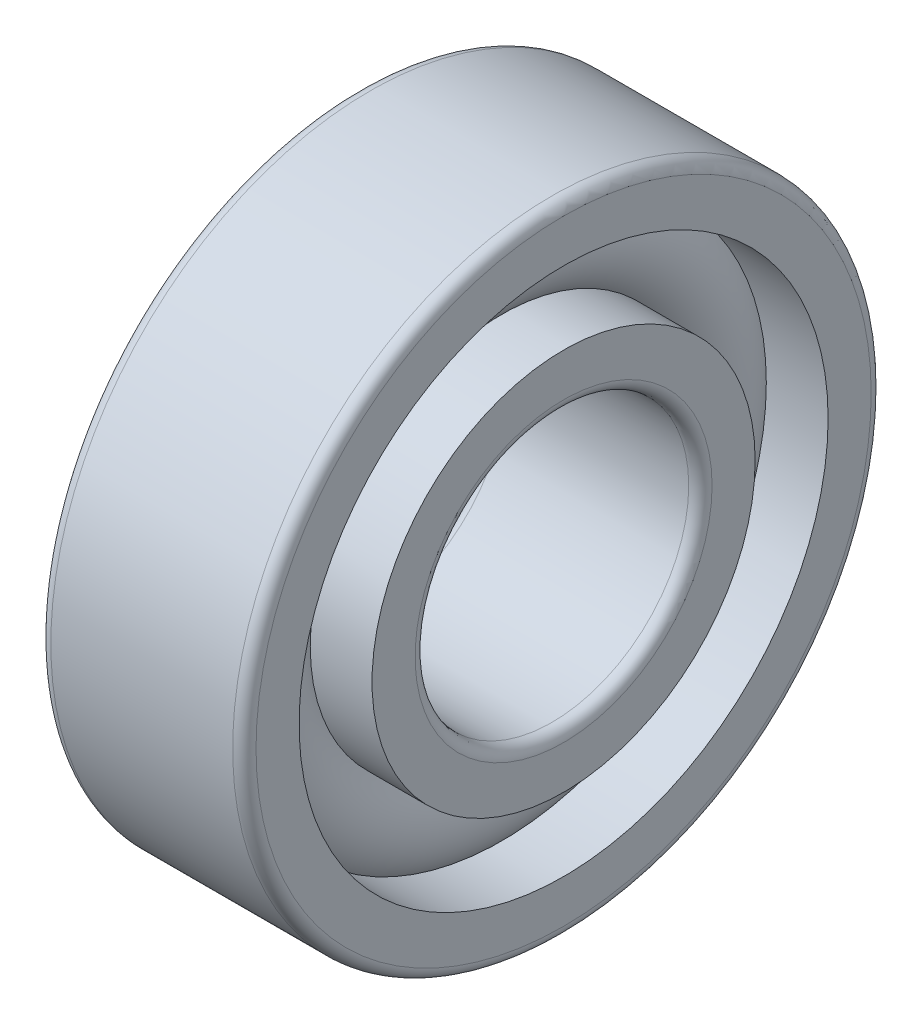
ISO-10303-21;
HEADER;
FILE_DESCRIPTION(('STEP AP214'),'2;1');
FILE_NAME('part.step','',(''),(''),'','','');
FILE_SCHEMA(('AUTOMOTIVE_DESIGN { 1 0 10303 214 1 1 1 1 }'));
ENDSEC;
DATA;
#1=APPLICATION_CONTEXT('core data for automotive mechanical design processes');
#2=APPLICATION_PROTOCOL_DEFINITION('international standard','automotive_design',2000,#1);
#3=PRODUCT_CONTEXT('',#1,'mechanical');
#4=PRODUCT('Part','Part','',(#3));
#5=PRODUCT_RELATED_PRODUCT_CATEGORY('part','',(#4));
#6=PRODUCT_DEFINITION_FORMATION('','',#4);
#7=PRODUCT_DEFINITION_CONTEXT('part definition',#1,'design');
#8=PRODUCT_DEFINITION('design','',#6,#7);
#9=PRODUCT_DEFINITION_SHAPE('','',#8);
#10=(LENGTH_UNIT() NAMED_UNIT(*) SI_UNIT(.MILLI.,.METRE.));
#11=(NAMED_UNIT(*) PLANE_ANGLE_UNIT() SI_UNIT($,.RADIAN.));
#12=(NAMED_UNIT(*) SI_UNIT($,.STERADIAN.) SOLID_ANGLE_UNIT());
#13=UNCERTAINTY_MEASURE_WITH_UNIT(LENGTH_MEASURE(1.E-05),#10,'distance_accuracy_value','');
#14=(GEOMETRIC_REPRESENTATION_CONTEXT(3) GLOBAL_UNCERTAINTY_ASSIGNED_CONTEXT((#13)) GLOBAL_UNIT_ASSIGNED_CONTEXT((#10,
#11,#12)) REPRESENTATION_CONTEXT('',''));
#15=CARTESIAN_POINT('',(0.,0.,0.));
#16=DIRECTION('',(0.,0.,1.));
#17=DIRECTION('',(1.,0.,0.));
#18=AXIS2_PLACEMENT_3D('',#15,#16,#17);
#19=CARTESIAN_POINT('',(0.,0.,0.));
#20=DIRECTION('',(-1.,0.,0.));
#21=DIRECTION('',(0.,0.,1.));
#22=AXIS2_PLACEMENT_3D('',#19,#20,#21);
#23=TOROIDAL_SURFACE('',#22,7.9375,1.905);
#24=CARTESIAN_POINT('',(1.41990316571236,0.,0.));
#25=DIRECTION('',(-1.,0.,0.));
#26=DIRECTION('',(0.,0.,1.));
#27=AXIS2_PLACEMENT_3D('',#24,#25,#26);
#28=CIRCLE('',#27,9.2075);
#29=CARTESIAN_POINT('',(1.41990316571236,0.,9.2075));
#30=VERTEX_POINT('',#29);
#31=EDGE_CURVE('E34',#30,#30,#28,.F.);
#32=ORIENTED_EDGE('',*,*,#31,.T.);
#33=EDGE_LOOP('',(#32));
#34=FACE_BOUND('',#33,.T.);
#35=CARTESIAN_POINT('',(1.41990316571237,0.,0.));
#36=DIRECTION('',(-1.,0.,0.));
#37=DIRECTION('',(0.,0.,1.));
#38=AXIS2_PLACEMENT_3D('',#35,#36,#37);
#39=CIRCLE('',#38,6.6675);
#40=CARTESIAN_POINT('',(1.41990316571237,0.,6.6675));
#41=VERTEX_POINT('',#40);
#42=EDGE_CURVE('E10',#41,#41,#39,.T.);
#43=ORIENTED_EDGE('',*,*,#42,.T.);
#44=EDGE_LOOP('',(#43));
#45=FACE_BOUND('',#44,.T.);
#46=ADVANCED_FACE('F30',(#34,#45),#23,.T.);
#47=CARTESIAN_POINT('',(-20.6375,0.,0.));
#48=DIRECTION('',(1.,0.,0.));
#49=DIRECTION('',(0.,0.,-1.));
#50=AXIS2_PLACEMENT_3D('',#47,#48,#49);
#51=CYLINDRICAL_SURFACE('',#50,6.6675);
#52=CARTESIAN_POINT('',(3.57124,0.,0.));
#53=DIRECTION('',(1.,0.,0.));
#54=DIRECTION('',(0.,0.,-1.));
#55=AXIS2_PLACEMENT_3D('',#52,#53,#54);
#56=CIRCLE('',#55,6.6675);
#57=CARTESIAN_POINT('',(3.57124,0.,-6.6675));
#58=VERTEX_POINT('',#57);
#59=EDGE_CURVE('E43',#58,#58,#56,.T.);
#60=ORIENTED_EDGE('',*,*,#59,.F.);
#61=EDGE_LOOP('',(#60));
#62=FACE_BOUND('',#61,.T.);
#63=ORIENTED_EDGE('',*,*,#42,.F.);
#64=EDGE_LOOP('',(#63));
#65=FACE_BOUND('',#64,.T.);
#66=ADVANCED_FACE('F82',(#62,#65),#51,.T.);
#67=CARTESIAN_POINT('',(-20.6375,0.,0.));
#68=DIRECTION('',(1.,0.,0.));
#69=DIRECTION('',(0.,0.,-1.));
#70=AXIS2_PLACEMENT_3D('',#67,#68,#69);
#71=CYLINDRICAL_SURFACE('',#70,6.6675);
#72=CARTESIAN_POINT('',(-3.57124,0.,0.));
#73=DIRECTION('',(1.,0.,0.));
#74=DIRECTION('',(0.,0.,-1.));
#75=AXIS2_PLACEMENT_3D('',#72,#73,#74);
#76=CIRCLE('',#75,6.6675);
#77=CARTESIAN_POINT('',(-3.57124,0.,-6.6675));
#78=VERTEX_POINT('',#77);
#79=EDGE_CURVE('E52',#78,#78,#76,.T.);
#80=ORIENTED_EDGE('',*,*,#79,.T.);
#81=EDGE_LOOP('',(#80));
#82=FACE_BOUND('',#81,.T.);
#83=CARTESIAN_POINT('',(-1.41990316571237,0.,0.));
#84=DIRECTION('',(1.,0.,0.));
#85=DIRECTION('',(0.,0.,-1.));
#86=AXIS2_PLACEMENT_3D('',#83,#84,#85);
#87=CIRCLE('',#86,6.6675);
#88=CARTESIAN_POINT('',(-1.41990316571237,0.,-6.6675));
#89=VERTEX_POINT('',#88);
#90=EDGE_CURVE('E38',#89,#89,#87,.T.);
#91=ORIENTED_EDGE('',*,*,#90,.F.);
#92=EDGE_LOOP('',(#91));
#93=FACE_BOUND('',#92,.T.);
#94=ADVANCED_FACE('F85',(#82,#93),#71,.T.);
#95=CARTESIAN_POINT('',(3.57124,5.1689,0.));
#96=DIRECTION('',(1.,0.,0.));
#97=DIRECTION('',(0.,0.,-1.));
#98=AXIS2_PLACEMENT_3D('',#95,#96,#97);
#99=PLANE('',#98);
#100=ORIENTED_EDGE('',*,*,#59,.T.);
#101=EDGE_LOOP('',(#100));
#102=FACE_BOUND('',#101,.T.);
#103=CARTESIAN_POINT('',(3.57124,0.,0.));
#104=DIRECTION('',(1.,0.,0.));
#105=DIRECTION('',(0.,0.,-1.));
#106=AXIS2_PLACEMENT_3D('',#103,#104,#105);
#107=CIRCLE('',#106,5.1689);
#108=CARTESIAN_POINT('',(3.57124,0.,-5.1689));
#109=VERTEX_POINT('',#108);
#110=EDGE_CURVE('E74',#109,#109,#107,.T.);
#111=ORIENTED_EDGE('',*,*,#110,.F.);
#112=EDGE_LOOP('',(#111));
#113=FACE_BOUND('',#112,.T.);
#114=ADVANCED_FACE('F79',(#102,#113),#99,.T.);
#115=CARTESIAN_POINT('',(3.16484,0.,0.));
#116=DIRECTION('',(1.,0.,0.));
#117=DIRECTION('',(0.,0.,-1.));
#118=AXIS2_PLACEMENT_3D('',#115,#116,#117);
#119=TOROIDAL_SURFACE('',#118,5.1689,0.406400000000001);
#120=ORIENTED_EDGE('',*,*,#110,.T.);
#121=EDGE_LOOP('',(#120));
#122=FACE_BOUND('',#121,.T.);
#123=CARTESIAN_POINT('',(3.16484,0.,0.));
#124=DIRECTION('',(1.,0.,0.));
#125=DIRECTION('',(0.,0.,-1.));
#126=AXIS2_PLACEMENT_3D('',#123,#124,#125);
#127=CIRCLE('',#126,4.7625);
#128=CARTESIAN_POINT('',(3.16484,0.,-4.7625));
#129=VERTEX_POINT('',#128);
#130=EDGE_CURVE('E71',#129,#129,#127,.T.);
#131=ORIENTED_EDGE('',*,*,#130,.F.);
#132=EDGE_LOOP('',(#131));
#133=FACE_BOUND('',#132,.T.);
#134=ADVANCED_FACE('F96',(#122,#133),#119,.T.);
#135=CARTESIAN_POINT('',(-20.6375,0.,0.));
#136=DIRECTION('',(1.,0.,0.));
#137=DIRECTION('',(0.,0.,-1.));
#138=AXIS2_PLACEMENT_3D('',#135,#136,#137);
#139=CYLINDRICAL_SURFACE('',#138,4.7625);
#140=ORIENTED_EDGE('',*,*,#130,.T.);
#141=EDGE_LOOP('',(#140));
#142=FACE_BOUND('',#141,.T.);
#143=CARTESIAN_POINT('',(-3.16484,0.,0.));
#144=DIRECTION('',(1.,0.,0.));
#145=DIRECTION('',(0.,0.,-1.));
#146=AXIS2_PLACEMENT_3D('',#143,#144,#145);
#147=CIRCLE('',#146,4.7625);
#148=CARTESIAN_POINT('',(-3.16484,0.,-4.7625));
#149=VERTEX_POINT('',#148);
#150=EDGE_CURVE('E68',#149,#149,#147,.T.);
#151=ORIENTED_EDGE('',*,*,#150,.F.);
#152=EDGE_LOOP('',(#151));
#153=FACE_BOUND('',#152,.T.);
#154=ADVANCED_FACE('F99',(#142,#153),#139,.F.);
#155=CARTESIAN_POINT('',(-3.16484,0.,0.));
#156=DIRECTION('',(1.,0.,0.));
#157=DIRECTION('',(0.,0.,-1.));
#158=AXIS2_PLACEMENT_3D('',#155,#156,#157);
#159=TOROIDAL_SURFACE('',#158,5.1689,0.406400000000001);
#160=ORIENTED_EDGE('',*,*,#150,.T.);
#161=EDGE_LOOP('',(#160));
#162=FACE_BOUND('',#161,.T.);
#163=CARTESIAN_POINT('',(-3.57124,0.,0.));
#164=DIRECTION('',(1.,0.,0.));
#165=DIRECTION('',(0.,0.,-1.));
#166=AXIS2_PLACEMENT_3D('',#163,#164,#165);
#167=CIRCLE('',#166,5.1689);
#168=CARTESIAN_POINT('',(-3.57124,0.,-5.1689));
#169=VERTEX_POINT('',#168);
#170=EDGE_CURVE('E65',#169,#169,#167,.T.);
#171=ORIENTED_EDGE('',*,*,#170,.F.);
#172=EDGE_LOOP('',(#171));
#173=FACE_BOUND('',#172,.T.);
#174=ADVANCED_FACE('F103',(#162,#173),#159,.T.);
#175=CARTESIAN_POINT('',(-3.57124,6.6675,0.));
#176=DIRECTION('',(-1.,0.,0.));
#177=DIRECTION('',(0.,0.,1.));
#178=AXIS2_PLACEMENT_3D('',#175,#176,#177);
#179=PLANE('',#178);
#180=ORIENTED_EDGE('',*,*,#170,.T.);
#181=EDGE_LOOP('',(#180));
#182=FACE_BOUND('',#181,.T.);
#183=ORIENTED_EDGE('',*,*,#79,.F.);
#184=EDGE_LOOP('',(#183));
#185=FACE_BOUND('',#184,.T.);
#186=ADVANCED_FACE('F107',(#182,#185),#179,.T.);
#187=CARTESIAN_POINT('',(-1.41990316571236,0.,0.));
#188=DIRECTION('',(1.,0.,0.));
#189=DIRECTION('',(0.,0.,-1.));
#190=AXIS2_PLACEMENT_3D('',#187,#188,#189);
#191=CIRCLE('',#190,9.2075);
#192=CARTESIAN_POINT('',(-1.41990316571236,0.,-9.2075));
#193=VERTEX_POINT('',#192);
#194=EDGE_CURVE('E46',#193,#193,#191,.F.);
#195=ORIENTED_EDGE('',*,*,#194,.T.);
#196=EDGE_LOOP('',(#195));
#197=FACE_BOUND('',#196,.T.);
#198=ORIENTED_EDGE('',*,*,#90,.T.);
#199=EDGE_LOOP('',(#198));
#200=FACE_BOUND('',#199,.T.);
#201=ADVANCED_FACE('F32',(#197,#200),#23,.T.);
#202=CARTESIAN_POINT('',(-20.6375,0.,0.));
#203=DIRECTION('',(1.,0.,0.));
#204=DIRECTION('',(0.,0.,-1.));
#205=AXIS2_PLACEMENT_3D('',#202,#203,#204);
#206=CYLINDRICAL_SURFACE('',#205,9.2075);
#207=CARTESIAN_POINT('',(3.57124,0.,0.));
#208=DIRECTION('',(1.,0.,0.));
#209=DIRECTION('',(0.,0.,-1.));
#210=AXIS2_PLACEMENT_3D('',#207,#208,#209);
#211=CIRCLE('',#210,9.2075);
#212=CARTESIAN_POINT('',(3.57124,0.,-9.2075));
#213=VERTEX_POINT('',#212);
#214=EDGE_CURVE('E48',#213,#213,#211,.T.);
#215=ORIENTED_EDGE('',*,*,#214,.T.);
#216=EDGE_LOOP('',(#215));
#217=FACE_BOUND('',#216,.T.);
#218=ORIENTED_EDGE('',*,*,#31,.F.);
#219=EDGE_LOOP('',(#218));
#220=FACE_BOUND('',#219,.T.);
#221=ADVANCED_FACE('F112',(#217,#220),#206,.F.);
#222=CARTESIAN_POINT('',(-20.6375,0.,0.));
#223=DIRECTION('',(1.,0.,0.));
#224=DIRECTION('',(0.,0.,-1.));
#225=AXIS2_PLACEMENT_3D('',#222,#223,#224);
#226=CYLINDRICAL_SURFACE('',#225,9.2075);
#227=CARTESIAN_POINT('',(-3.57124,0.,0.));
#228=DIRECTION('',(1.,0.,0.));
#229=DIRECTION('',(0.,0.,-1.));
#230=AXIS2_PLACEMENT_3D('',#227,#228,#229);
#231=CIRCLE('',#230,9.2075);
#232=CARTESIAN_POINT('',(-3.57124,0.,-9.2075));
#233=VERTEX_POINT('',#232);
#234=EDGE_CURVE('E143',#233,#233,#231,.T.);
#235=ORIENTED_EDGE('',*,*,#234,.F.);
#236=EDGE_LOOP('',(#235));
#237=FACE_BOUND('',#236,.T.);
#238=ORIENTED_EDGE('',*,*,#194,.F.);
#239=EDGE_LOOP('',(#238));
#240=FACE_BOUND('',#239,.T.);
#241=ADVANCED_FACE('F115',(#237,#240),#226,.F.);
#242=CARTESIAN_POINT('',(3.57124,10.7061,0.));
#243=DIRECTION('',(1.,0.,0.));
#244=DIRECTION('',(0.,0.,-1.));
#245=AXIS2_PLACEMENT_3D('',#242,#243,#244);
#246=PLANE('',#245);
#247=CARTESIAN_POINT('',(3.57124,0.,0.));
#248=DIRECTION('',(1.,0.,0.));
#249=DIRECTION('',(0.,0.,-1.));
#250=AXIS2_PLACEMENT_3D('',#247,#248,#249);
#251=CIRCLE('',#250,10.7061);
#252=CARTESIAN_POINT('',(3.57124,0.,-10.7061));
#253=VERTEX_POINT('',#252);
#254=EDGE_CURVE('E54',#253,#253,#251,.T.);
#255=ORIENTED_EDGE('',*,*,#254,.T.);
#256=EDGE_LOOP('',(#255));
#257=FACE_BOUND('',#256,.T.);
#258=ORIENTED_EDGE('',*,*,#214,.F.);
#259=EDGE_LOOP('',(#258));
#260=FACE_BOUND('',#259,.T.);
#261=ADVANCED_FACE('F116',(#257,#260),#246,.T.);
#262=CARTESIAN_POINT('',(3.16484,0.,0.));
#263=DIRECTION('',(1.,0.,0.));
#264=DIRECTION('',(0.,0.,-1.));
#265=AXIS2_PLACEMENT_3D('',#262,#263,#264);
#266=TOROIDAL_SURFACE('',#265,10.7061,0.406400000000001);
#267=CARTESIAN_POINT('',(3.16484,0.,0.));
#268=DIRECTION('',(1.,0.,0.));
#269=DIRECTION('',(0.,0.,-1.));
#270=AXIS2_PLACEMENT_3D('',#267,#268,#269);
#271=CIRCLE('',#270,11.1125);
#272=CARTESIAN_POINT('',(3.16484,0.,-11.1125));
#273=VERTEX_POINT('',#272);
#274=EDGE_CURVE('E59',#273,#273,#271,.T.);
#275=ORIENTED_EDGE('',*,*,#274,.T.);
#276=EDGE_LOOP('',(#275));
#277=FACE_BOUND('',#276,.T.);
#278=ORIENTED_EDGE('',*,*,#254,.F.);
#279=EDGE_LOOP('',(#278));
#280=FACE_BOUND('',#279,.T.);
#281=ADVANCED_FACE('F119',(#277,#280),#266,.T.);
#282=CARTESIAN_POINT('',(-20.6375,0.,0.));
#283=DIRECTION('',(1.,0.,0.));
#284=DIRECTION('',(0.,0.,-1.));
#285=AXIS2_PLACEMENT_3D('',#282,#283,#284);
#286=CYLINDRICAL_SURFACE('',#285,11.1125);
#287=CARTESIAN_POINT('',(-3.16484,0.,0.));
#288=DIRECTION('',(1.,0.,0.));
#289=DIRECTION('',(0.,0.,-1.));
#290=AXIS2_PLACEMENT_3D('',#287,#288,#289);
#291=CIRCLE('',#290,11.1125);
#292=CARTESIAN_POINT('',(-3.16484,0.,-11.1125));
#293=VERTEX_POINT('',#292);
#294=EDGE_CURVE('E147',#293,#293,#291,.T.);
#295=ORIENTED_EDGE('',*,*,#294,.T.);
#296=EDGE_LOOP('',(#295));
#297=FACE_BOUND('',#296,.T.);
#298=ORIENTED_EDGE('',*,*,#274,.F.);
#299=EDGE_LOOP('',(#298));
#300=FACE_BOUND('',#299,.T.);
#301=ADVANCED_FACE('F123',(#297,#300),#286,.T.);
#302=CARTESIAN_POINT('',(-3.16484,0.,0.));
#303=DIRECTION('',(1.,0.,0.));
#304=DIRECTION('',(0.,0.,-1.));
#305=AXIS2_PLACEMENT_3D('',#302,#303,#304);
#306=TOROIDAL_SURFACE('',#305,10.7061,0.406400000000001);
#307=CARTESIAN_POINT('',(-3.57124,0.,0.));
#308=DIRECTION('',(1.,0.,0.));
#309=DIRECTION('',(0.,0.,-1.));
#310=AXIS2_PLACEMENT_3D('',#307,#308,#309);
#311=CIRCLE('',#310,10.7061);
#312=CARTESIAN_POINT('',(-3.57124,0.,-10.7061));
#313=VERTEX_POINT('',#312);
#314=EDGE_CURVE('E144',#313,#313,#311,.T.);
#315=ORIENTED_EDGE('',*,*,#314,.T.);
#316=EDGE_LOOP('',(#315));
#317=FACE_BOUND('',#316,.T.);
#318=ORIENTED_EDGE('',*,*,#294,.F.);
#319=EDGE_LOOP('',(#318));
#320=FACE_BOUND('',#319,.T.);
#321=ADVANCED_FACE('F127',(#317,#320),#306,.T.);
#322=CARTESIAN_POINT('',(-3.57124,9.2075,0.));
#323=DIRECTION('',(-1.,0.,0.));
#324=DIRECTION('',(0.,0.,1.));
#325=AXIS2_PLACEMENT_3D('',#322,#323,#324);
#326=PLANE('',#325);
#327=ORIENTED_EDGE('',*,*,#234,.T.);
#328=EDGE_LOOP('',(#327));
#329=FACE_BOUND('',#328,.T.);
#330=ORIENTED_EDGE('',*,*,#314,.F.);
#331=EDGE_LOOP('',(#330));
#332=FACE_BOUND('',#331,.T.);
#333=ADVANCED_FACE('F131',(#329,#332),#326,.T.);
#334=CLOSED_SHELL('',(#46,#66,#94,#114,#134,#154,#174,#186,#201,#221,#241,#261,#281,#301,#321,#333));
#335=MANIFOLD_SOLID_BREP('B2',#334);
#336=ADVANCED_BREP_SHAPE_REPRESENTATION('',(#18,#335),#14);
#337=SHAPE_DEFINITION_REPRESENTATION(#9,#336);
ENDSEC;
END-ISO-10303-21;
